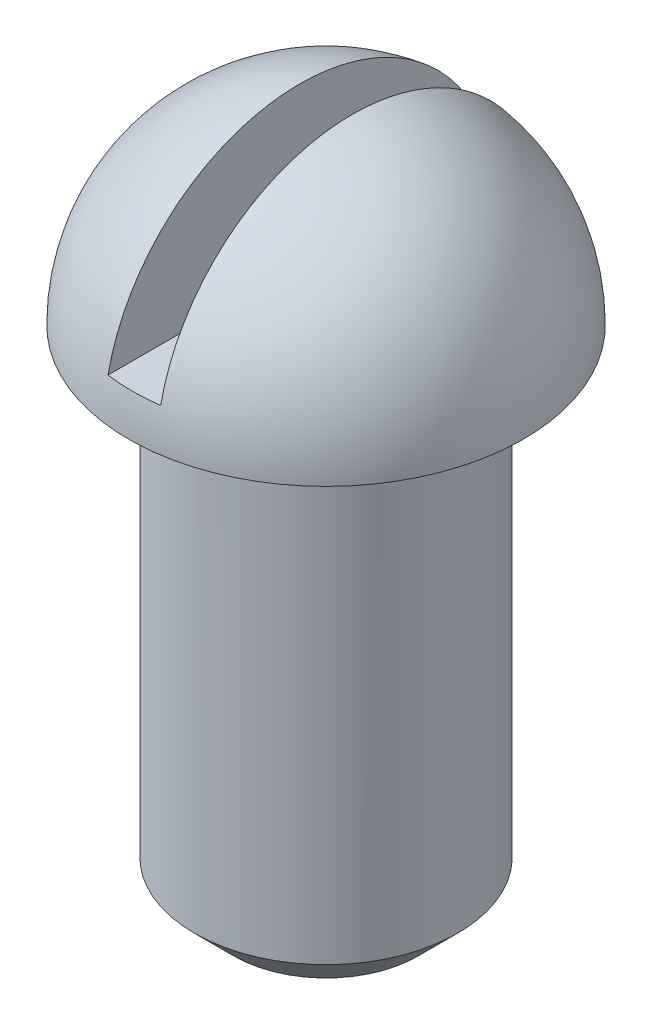
ISO-10303-21;
HEADER;
FILE_DESCRIPTION(('STEP AP214'),'2;1');
FILE_NAME('part.step','',(''),(''),'','','');
FILE_SCHEMA(('AUTOMOTIVE_DESIGN { 1 0 10303 214 1 1 1 1 }'));
ENDSEC;
DATA;
#1=APPLICATION_CONTEXT('core data for automotive mechanical design processes');
#2=APPLICATION_PROTOCOL_DEFINITION('international standard','automotive_design',2000,#1);
#3=PRODUCT_CONTEXT('',#1,'mechanical');
#4=PRODUCT('Part','Part','',(#3));
#5=PRODUCT_RELATED_PRODUCT_CATEGORY('part','',(#4));
#6=PRODUCT_DEFINITION_FORMATION('','',#4);
#7=PRODUCT_DEFINITION_CONTEXT('part definition',#1,'design');
#8=PRODUCT_DEFINITION('design','',#6,#7);
#9=PRODUCT_DEFINITION_SHAPE('','',#8);
#10=(LENGTH_UNIT() NAMED_UNIT(*) SI_UNIT(.MILLI.,.METRE.));
#11=(NAMED_UNIT(*) PLANE_ANGLE_UNIT() SI_UNIT($,.RADIAN.));
#12=(NAMED_UNIT(*) SI_UNIT($,.STERADIAN.) SOLID_ANGLE_UNIT());
#13=UNCERTAINTY_MEASURE_WITH_UNIT(LENGTH_MEASURE(1.E-05),#10,'distance_accuracy_value','');
#14=(GEOMETRIC_REPRESENTATION_CONTEXT(3) GLOBAL_UNCERTAINTY_ASSIGNED_CONTEXT((#13)) GLOBAL_UNIT_ASSIGNED_CONTEXT((#10,
#11,#12)) REPRESENTATION_CONTEXT('',''));
#15=CARTESIAN_POINT('',(0.,0.,0.));
#16=DIRECTION('',(0.,0.,1.));
#17=DIRECTION('',(1.,0.,0.));
#18=AXIS2_PLACEMENT_3D('',#15,#16,#17);
#19=CARTESIAN_POINT('',(10.,-13.6594970156378,0.));
#20=DIRECTION('',(0.,-1.,0.));
#21=DIRECTION('',(0.,0.,-1.));
#22=AXIS2_PLACEMENT_3D('',#19,#20,#21);
#23=CYLINDRICAL_SURFACE('',#22,10.);
#24=CARTESIAN_POINT('',(10.,3.00000000000003,0.));
#25=DIRECTION('',(0.,1.,0.));
#26=DIRECTION('',(0.,0.,1.));
#27=AXIS2_PLACEMENT_3D('',#24,#25,#26);
#28=CIRCLE('',#27,10.);
#29=CARTESIAN_POINT('',(10.,3.00000000000003,10.));
#30=VERTEX_POINT('',#29);
#31=EDGE_CURVE('E11',#30,#30,#28,.T.);
#32=ORIENTED_EDGE('',*,*,#31,.T.);
#33=EDGE_LOOP('',(#32));
#34=FACE_BOUND('',#33,.T.);
#35=CARTESIAN_POINT('',(10.,38.,0.));
#36=DIRECTION('',(0.,-1.,0.));
#37=DIRECTION('',(0.,0.,-1.));
#38=AXIS2_PLACEMENT_3D('',#35,#36,#37);
#39=CIRCLE('',#38,10.);
#40=CARTESIAN_POINT('',(10.,38.,-10.));
#41=VERTEX_POINT('',#40);
#42=EDGE_CURVE('E116',#41,#41,#39,.T.);
#43=ORIENTED_EDGE('',*,*,#42,.T.);
#44=EDGE_LOOP('',(#43));
#45=FACE_BOUND('',#44,.T.);
#46=ADVANCED_FACE('F38',(#34,#45),#23,.T.);
#47=CARTESIAN_POINT('',(0.,0.,0.));
#48=DIRECTION('',(0.,1.,0.));
#49=DIRECTION('',(0.,0.,1.));
#50=AXIS2_PLACEMENT_3D('',#47,#48,#49);
#51=PLANE('',#50);
#52=CARTESIAN_POINT('',(10.,0.,0.));
#53=DIRECTION('',(0.,1.,0.));
#54=DIRECTION('',(0.,0.,1.));
#55=AXIS2_PLACEMENT_3D('',#52,#53,#54);
#56=CIRCLE('',#55,6.99999999999999);
#57=CARTESIAN_POINT('',(10.,0.,6.99999999999999));
#58=VERTEX_POINT('',#57);
#59=EDGE_CURVE('E47',#58,#58,#56,.F.);
#60=ORIENTED_EDGE('',*,*,#59,.T.);
#61=EDGE_LOOP('',(#60));
#62=FACE_BOUND('',#61,.T.);
#63=ADVANCED_FACE('F86',(#62),#51,.F.);
#64=CARTESIAN_POINT('',(10.,38.,0.));
#65=DIRECTION('',(0.,-1.,0.));
#66=DIRECTION('',(-1.,0.,0.));
#67=AXIS2_PLACEMENT_3D('',#64,#65,#66);
#68=SPHERICAL_SURFACE('',#67,15.);
#69=CARTESIAN_POINT('',(12.,38.,0.));
#70=DIRECTION('',(1.,0.,0.));
#71=DIRECTION('',(0.,1.,0.));
#72=AXIS2_PLACEMENT_3D('',#69,#70,#71);
#73=CIRCLE('',#72,14.8660687473185);
#74=CARTESIAN_POINT('',(12.,41.,-14.560219778561));
#75=VERTEX_POINT('',#74);
#76=CARTESIAN_POINT('',(12.,41.,14.560219778561));
#77=VERTEX_POINT('',#76);
#78=EDGE_CURVE('E72',#75,#77,#73,.T.);
#79=ORIENTED_EDGE('',*,*,#78,.T.);
#80=CARTESIAN_POINT('',(10.,41.,0.));
#81=DIRECTION('',(0.,-1.,0.));
#82=DIRECTION('',(0.,0.,-1.));
#83=AXIS2_PLACEMENT_3D('',#80,#81,#82);
#84=CIRCLE('',#83,14.6969384566991);
#85=CARTESIAN_POINT('',(8.,41.,14.560219778561));
#86=VERTEX_POINT('',#85);
#87=EDGE_CURVE('E59',#77,#86,#84,.T.);
#88=ORIENTED_EDGE('',*,*,#87,.T.);
#89=CARTESIAN_POINT('',(8.,38.,0.));
#90=DIRECTION('',(-1.,0.,0.));
#91=DIRECTION('',(0.,-1.,0.));
#92=AXIS2_PLACEMENT_3D('',#89,#90,#91);
#93=CIRCLE('',#92,14.8660687473185);
#94=CARTESIAN_POINT('',(8.,41.,-14.560219778561));
#95=VERTEX_POINT('',#94);
#96=EDGE_CURVE('E77',#86,#95,#93,.T.);
#97=ORIENTED_EDGE('',*,*,#96,.T.);
#98=EDGE_CURVE('E65',#95,#75,#84,.T.);
#99=ORIENTED_EDGE('',*,*,#98,.T.);
#100=EDGE_LOOP('',(#79,#88,#97,#99));
#101=FACE_BOUND('',#100,.T.);
#102=CARTESIAN_POINT('',(10.,38.,0.));
#103=DIRECTION('',(0.,-1.,0.));
#104=DIRECTION('',(0.,0.,-1.));
#105=AXIS2_PLACEMENT_3D('',#102,#103,#104);
#106=CIRCLE('',#105,15.);
#107=CARTESIAN_POINT('',(10.,38.,-15.));
#108=VERTEX_POINT('',#107);
#109=EDGE_CURVE('E73',#108,#108,#106,.T.);
#110=ORIENTED_EDGE('',*,*,#109,.F.);
#111=EDGE_LOOP('',(#110));
#112=FACE_BOUND('',#111,.T.);
#113=ADVANCED_FACE('F79',(#101,#112),#68,.T.);
#114=CARTESIAN_POINT('',(0.,38.,0.));
#115=DIRECTION('',(0.,1.,0.));
#116=DIRECTION('',(0.,0.,1.));
#117=AXIS2_PLACEMENT_3D('',#114,#115,#116);
#118=PLANE('',#117);
#119=ORIENTED_EDGE('',*,*,#42,.F.);
#120=EDGE_LOOP('',(#119));
#121=FACE_BOUND('',#120,.T.);
#122=ORIENTED_EDGE('',*,*,#109,.T.);
#123=EDGE_LOOP('',(#122));
#124=FACE_BOUND('',#123,.T.);
#125=ADVANCED_FACE('F106',(#121,#124),#118,.F.);
#126=CARTESIAN_POINT('',(8.,56.,-27.5));
#127=DIRECTION('',(-1.,0.,0.));
#128=DIRECTION('',(0.,-1.,0.));
#129=AXIS2_PLACEMENT_3D('',#126,#127,#128);
#130=PLANE('',#129);
#131=DIRECTION('',(0.,0.,1.));
#132=VECTOR('',#131,1.);
#133=CARTESIAN_POINT('',(8.,41.,-27.5));
#134=LINE('',#133,#132);
#135=EDGE_CURVE('E68',#95,#86,#134,.T.);
#136=ORIENTED_EDGE('',*,*,#135,.F.);
#137=ORIENTED_EDGE('',*,*,#96,.F.);
#138=EDGE_LOOP('',(#136,#137));
#139=FACE_BOUND('',#138,.T.);
#140=ADVANCED_FACE('F76',(#139),#130,.F.);
#141=CARTESIAN_POINT('',(12.,56.,-27.5));
#142=DIRECTION('',(1.,0.,0.));
#143=DIRECTION('',(0.,1.,0.));
#144=AXIS2_PLACEMENT_3D('',#141,#142,#143);
#145=PLANE('',#144);
#146=DIRECTION('',(0.,0.,1.));
#147=VECTOR('',#146,1.);
#148=CARTESIAN_POINT('',(12.,41.,-27.5));
#149=LINE('',#148,#147);
#150=EDGE_CURVE('E54',#75,#77,#149,.T.);
#151=ORIENTED_EDGE('',*,*,#150,.T.);
#152=ORIENTED_EDGE('',*,*,#78,.F.);
#153=EDGE_LOOP('',(#151,#152));
#154=FACE_BOUND('',#153,.T.);
#155=ADVANCED_FACE('F93',(#154),#145,.F.);
#156=CARTESIAN_POINT('',(8.,41.,-27.5));
#157=DIRECTION('',(0.,-1.,0.));
#158=DIRECTION('',(0.,0.,-1.));
#159=AXIS2_PLACEMENT_3D('',#156,#157,#158);
#160=PLANE('',#159);
#161=ORIENTED_EDGE('',*,*,#150,.F.);
#162=ORIENTED_EDGE('',*,*,#98,.F.);
#163=ORIENTED_EDGE('',*,*,#135,.T.);
#164=ORIENTED_EDGE('',*,*,#87,.F.);
#165=EDGE_LOOP('',(#161,#162,#163,#164));
#166=FACE_BOUND('',#165,.T.);
#167=ADVANCED_FACE('F67',(#166),#160,.F.);
#168=CARTESIAN_POINT('',(10.,0.,0.));
#169=DIRECTION('',(0.,1.,0.));
#170=DIRECTION('',(0.,0.,1.));
#171=AXIS2_PLACEMENT_3D('',#168,#169,#170);
#172=CONICAL_SURFACE('',#171,6.99999999999999,0.785398163397446);
#173=ORIENTED_EDGE('',*,*,#31,.F.);
#174=EDGE_LOOP('',(#173));
#175=FACE_BOUND('',#174,.T.);
#176=ORIENTED_EDGE('',*,*,#59,.F.);
#177=EDGE_LOOP('',(#176));
#178=FACE_BOUND('',#177,.T.);
#179=ADVANCED_FACE('F41',(#175,#178),#172,.T.);
#180=CLOSED_SHELL('',(#46,#63,#113,#125,#140,#155,#167,#179));
#181=MANIFOLD_SOLID_BREP('B2',#180);
#182=ADVANCED_BREP_SHAPE_REPRESENTATION('',(#18,#181),#14);
#183=SHAPE_DEFINITION_REPRESENTATION(#9,#182);
ENDSEC;
END-ISO-10303-21;
